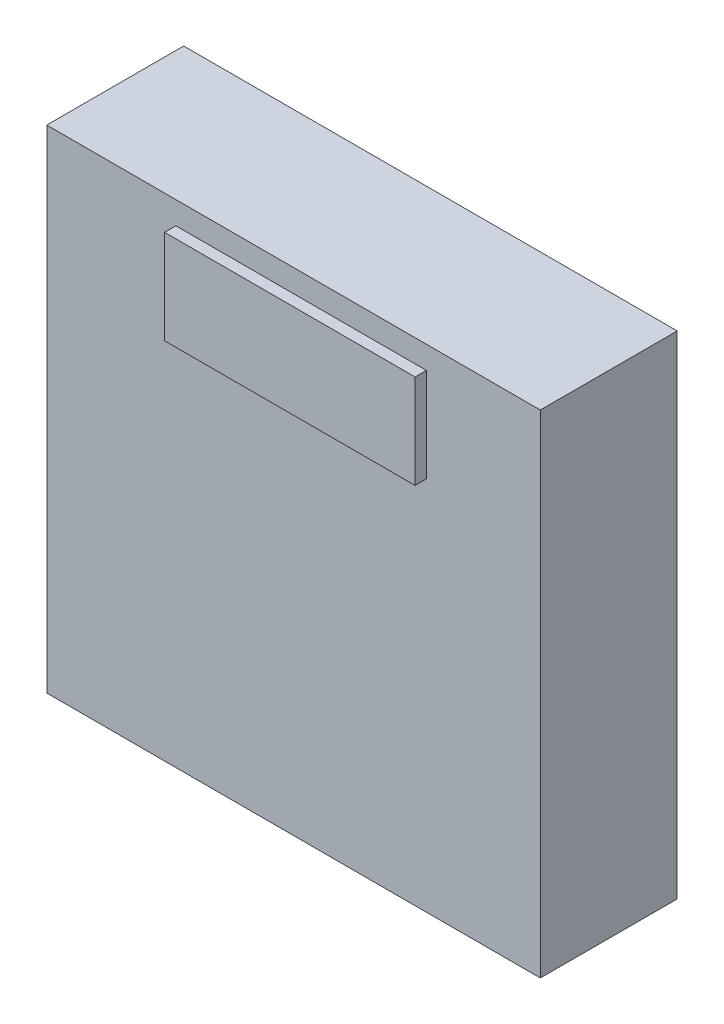
ISO-10303-21;
HEADER;
FILE_DESCRIPTION(('STEP AP214'),'2;1');
FILE_NAME('part.step','',(''),(''),'','','');
FILE_SCHEMA(('AUTOMOTIVE_DESIGN { 1 0 10303 214 1 1 1 1 }'));
ENDSEC;
DATA;
#1=APPLICATION_CONTEXT('core data for automotive mechanical design processes');
#2=APPLICATION_PROTOCOL_DEFINITION('international standard','automotive_design',2000,#1);
#3=PRODUCT_CONTEXT('',#1,'mechanical');
#4=PRODUCT('Part','Part','',(#3));
#5=PRODUCT_RELATED_PRODUCT_CATEGORY('part','',(#4));
#6=PRODUCT_DEFINITION_FORMATION('','',#4);
#7=PRODUCT_DEFINITION_CONTEXT('part definition',#1,'design');
#8=PRODUCT_DEFINITION('design','',#6,#7);
#9=PRODUCT_DEFINITION_SHAPE('','',#8);
#10=(LENGTH_UNIT() NAMED_UNIT(*) SI_UNIT(.MILLI.,.METRE.));
#11=(NAMED_UNIT(*) PLANE_ANGLE_UNIT() SI_UNIT($,.RADIAN.));
#12=(NAMED_UNIT(*) SI_UNIT($,.STERADIAN.) SOLID_ANGLE_UNIT());
#13=UNCERTAINTY_MEASURE_WITH_UNIT(LENGTH_MEASURE(1.E-05),#10,'distance_accuracy_value','');
#14=(GEOMETRIC_REPRESENTATION_CONTEXT(3) GLOBAL_UNCERTAINTY_ASSIGNED_CONTEXT((#13)) GLOBAL_UNIT_ASSIGNED_CONTEXT((#10,
#11,#12)) REPRESENTATION_CONTEXT('',''));
#15=CARTESIAN_POINT('',(0.,0.,0.));
#16=DIRECTION('',(0.,0.,1.));
#17=DIRECTION('',(1.,0.,0.));
#18=AXIS2_PLACEMENT_3D('',#15,#16,#17);
#19=CARTESIAN_POINT('',(0.,0.,30.6832));
#20=DIRECTION('',(0.,0.,1.));
#21=DIRECTION('',(1.,0.,0.));
#22=AXIS2_PLACEMENT_3D('',#19,#20,#21);
#23=PLANE('',#22);
#24=DIRECTION('',(0.,-1.,0.));
#25=VECTOR('',#24,1.);
#26=CARTESIAN_POINT('',(-55.2958,-55.11165,30.6832));
#27=LINE('',#26,#25);
#28=CARTESIAN_POINT('',(-55.2958,55.11165,30.6832));
#29=VERTEX_POINT('',#28);
#30=CARTESIAN_POINT('',(-55.2958,-55.11165,30.6832));
#31=VERTEX_POINT('',#30);
#32=EDGE_CURVE('E142',#29,#31,#27,.T.);
#33=ORIENTED_EDGE('',*,*,#32,.T.);
#34=DIRECTION('',(1.,0.,0.));
#35=VECTOR('',#34,1.);
#36=CARTESIAN_POINT('',(55.2958,-55.11165,30.6832));
#37=LINE('',#36,#35);
#38=CARTESIAN_POINT('',(55.2958,-55.11165,30.6832));
#39=VERTEX_POINT('',#38);
#40=EDGE_CURVE('E87',#31,#39,#37,.T.);
#41=ORIENTED_EDGE('',*,*,#40,.T.);
#42=DIRECTION('',(0.,1.,0.));
#43=VECTOR('',#42,1.);
#44=CARTESIAN_POINT('',(55.2958,-55.11165,30.6832));
#45=LINE('',#44,#43);
#46=CARTESIAN_POINT('',(55.2958,55.11165,30.6832));
#47=VERTEX_POINT('',#46);
#48=EDGE_CURVE('E145',#39,#47,#45,.T.);
#49=ORIENTED_EDGE('',*,*,#48,.T.);
#50=DIRECTION('',(-1.,0.,0.));
#51=VECTOR('',#50,1.);
#52=CARTESIAN_POINT('',(55.2958,55.11165,30.6832));
#53=LINE('',#52,#51);
#54=EDGE_CURVE('E59',#47,#29,#53,.T.);
#55=ORIENTED_EDGE('',*,*,#54,.T.);
#56=EDGE_LOOP('',(#33,#41,#49,#55));
#57=FACE_BOUND('',#56,.T.);
#58=DIRECTION('',(1.,0.,0.));
#59=VECTOR('',#58,1.);
#60=CARTESIAN_POINT('',(-26.3652,28.98775,30.6832));
#61=LINE('',#60,#59);
#62=CARTESIAN_POINT('',(-26.3652,28.98775,30.6832));
#63=VERTEX_POINT('',#62);
#64=CARTESIAN_POINT('',(29.7688,28.98775,30.6832));
#65=VERTEX_POINT('',#64);
#66=EDGE_CURVE('E267',#63,#65,#61,.T.);
#67=ORIENTED_EDGE('',*,*,#66,.F.);
#68=DIRECTION('',(0.,-1.,0.));
#69=VECTOR('',#68,1.);
#70=CARTESIAN_POINT('',(-26.3652,50.03165,30.6832));
#71=LINE('',#70,#69);
#72=CARTESIAN_POINT('',(-26.3652,50.03165,30.6832));
#73=VERTEX_POINT('',#72);
#74=EDGE_CURVE('E132',#73,#63,#71,.T.);
#75=ORIENTED_EDGE('',*,*,#74,.F.);
#76=DIRECTION('',(-1.,0.,0.));
#77=VECTOR('',#76,1.);
#78=CARTESIAN_POINT('',(-26.3652,50.03165,30.6832));
#79=LINE('',#78,#77);
#80=CARTESIAN_POINT('',(29.7688,50.03165,30.6832));
#81=VERTEX_POINT('',#80);
#82=EDGE_CURVE('E128',#81,#73,#79,.T.);
#83=ORIENTED_EDGE('',*,*,#82,.F.);
#84=DIRECTION('',(0.,1.,0.));
#85=VECTOR('',#84,1.);
#86=CARTESIAN_POINT('',(29.7688,50.03165,30.6832));
#87=LINE('',#86,#85);
#88=EDGE_CURVE('E264',#65,#81,#87,.T.);
#89=ORIENTED_EDGE('',*,*,#88,.F.);
#90=EDGE_LOOP('',(#67,#75,#83,#89));
#91=FACE_BOUND('',#90,.T.);
#92=ADVANCED_FACE('F35',(#57,#91),#23,.T.);
#93=CARTESIAN_POINT('',(-55.2958,-55.11165,30.6832));
#94=DIRECTION('',(1.,0.,0.));
#95=DIRECTION('',(0.,0.,-1.));
#96=AXIS2_PLACEMENT_3D('',#93,#94,#95);
#97=PLANE('',#96);
#98=DIRECTION('',(0.,-1.,0.));
#99=VECTOR('',#98,1.);
#100=CARTESIAN_POINT('',(-55.2958,-55.11165,0.));
#101=LINE('',#100,#99);
#102=CARTESIAN_POINT('',(-55.2958,55.11165,0.));
#103=VERTEX_POINT('',#102);
#104=CARTESIAN_POINT('',(-55.2958,-55.11165,0.));
#105=VERTEX_POINT('',#104);
#106=EDGE_CURVE('E134',#103,#105,#101,.T.);
#107=ORIENTED_EDGE('',*,*,#106,.T.);
#108=DIRECTION('',(0.,0.,-1.));
#109=VECTOR('',#108,1.);
#110=CARTESIAN_POINT('',(-55.2958,-55.11165,30.6832));
#111=LINE('',#110,#109);
#112=EDGE_CURVE('E11',#31,#105,#111,.T.);
#113=ORIENTED_EDGE('',*,*,#112,.F.);
#114=ORIENTED_EDGE('',*,*,#32,.F.);
#115=DIRECTION('',(0.,0.,-1.));
#116=VECTOR('',#115,1.);
#117=CARTESIAN_POINT('',(-55.2958,55.11165,30.6832));
#118=LINE('',#117,#116);
#119=EDGE_CURVE('E147',#29,#103,#118,.T.);
#120=ORIENTED_EDGE('',*,*,#119,.T.);
#121=EDGE_LOOP('',(#107,#113,#114,#120));
#122=FACE_BOUND('',#121,.T.);
#123=ADVANCED_FACE('F37',(#122),#97,.F.);
#124=CARTESIAN_POINT('',(55.2958,-55.11165,30.6832));
#125=DIRECTION('',(0.,1.,0.));
#126=DIRECTION('',(0.,0.,1.));
#127=AXIS2_PLACEMENT_3D('',#124,#125,#126);
#128=PLANE('',#127);
#129=DIRECTION('',(1.,0.,0.));
#130=VECTOR('',#129,1.);
#131=CARTESIAN_POINT('',(55.2958,-55.11165,0.));
#132=LINE('',#131,#130);
#133=CARTESIAN_POINT('',(55.2958,-55.11165,0.));
#134=VERTEX_POINT('',#133);
#135=EDGE_CURVE('E137',#105,#134,#132,.T.);
#136=ORIENTED_EDGE('',*,*,#135,.T.);
#137=DIRECTION('',(0.,0.,-1.));
#138=VECTOR('',#137,1.);
#139=CARTESIAN_POINT('',(55.2958,-55.11165,30.6832));
#140=LINE('',#139,#138);
#141=EDGE_CURVE('E43',#39,#134,#140,.T.);
#142=ORIENTED_EDGE('',*,*,#141,.F.);
#143=ORIENTED_EDGE('',*,*,#40,.F.);
#144=ORIENTED_EDGE('',*,*,#112,.T.);
#145=EDGE_LOOP('',(#136,#142,#143,#144));
#146=FACE_BOUND('',#145,.T.);
#147=ADVANCED_FACE('F175',(#146),#128,.F.);
#148=CARTESIAN_POINT('',(55.2958,-55.11165,30.6832));
#149=DIRECTION('',(-1.,0.,0.));
#150=DIRECTION('',(0.,0.,1.));
#151=AXIS2_PLACEMENT_3D('',#148,#149,#150);
#152=PLANE('',#151);
#153=DIRECTION('',(0.,1.,0.));
#154=VECTOR('',#153,1.);
#155=CARTESIAN_POINT('',(55.2958,-55.11165,0.));
#156=LINE('',#155,#154);
#157=CARTESIAN_POINT('',(55.2958,55.11165,0.));
#158=VERTEX_POINT('',#157);
#159=EDGE_CURVE('E150',#134,#158,#156,.T.);
#160=ORIENTED_EDGE('',*,*,#159,.T.);
#161=DIRECTION('',(0.,0.,-1.));
#162=VECTOR('',#161,1.);
#163=CARTESIAN_POINT('',(55.2958,55.11165,30.6832));
#164=LINE('',#163,#162);
#165=EDGE_CURVE('E154',#47,#158,#164,.T.);
#166=ORIENTED_EDGE('',*,*,#165,.F.);
#167=ORIENTED_EDGE('',*,*,#48,.F.);
#168=ORIENTED_EDGE('',*,*,#141,.T.);
#169=EDGE_LOOP('',(#160,#166,#167,#168));
#170=FACE_BOUND('',#169,.T.);
#171=ADVANCED_FACE('F159',(#170),#152,.F.);
#172=CARTESIAN_POINT('',(55.2958,55.11165,30.6832));
#173=DIRECTION('',(0.,-1.,0.));
#174=DIRECTION('',(0.,0.,-1.));
#175=AXIS2_PLACEMENT_3D('',#172,#173,#174);
#176=PLANE('',#175);
#177=DIRECTION('',(-1.,0.,0.));
#178=VECTOR('',#177,1.);
#179=CARTESIAN_POINT('',(55.2958,55.11165,0.));
#180=LINE('',#179,#178);
#181=EDGE_CURVE('E80',#158,#103,#180,.T.);
#182=ORIENTED_EDGE('',*,*,#181,.T.);
#183=ORIENTED_EDGE('',*,*,#119,.F.);
#184=ORIENTED_EDGE('',*,*,#54,.F.);
#185=ORIENTED_EDGE('',*,*,#165,.T.);
#186=EDGE_LOOP('',(#182,#183,#184,#185));
#187=FACE_BOUND('',#186,.T.);
#188=ADVANCED_FACE('F167',(#187),#176,.F.);
#189=CARTESIAN_POINT('',(0.,0.,0.));
#190=DIRECTION('',(0.,0.,1.));
#191=DIRECTION('',(1.,0.,0.));
#192=AXIS2_PLACEMENT_3D('',#189,#190,#191);
#193=PLANE('',#192);
#194=ORIENTED_EDGE('',*,*,#106,.F.);
#195=ORIENTED_EDGE('',*,*,#181,.F.);
#196=ORIENTED_EDGE('',*,*,#159,.F.);
#197=ORIENTED_EDGE('',*,*,#135,.F.);
#198=EDGE_LOOP('',(#194,#195,#196,#197));
#199=FACE_BOUND('',#198,.T.);
#200=ADVANCED_FACE('F163',(#199),#193,.F.);
#201=CARTESIAN_POINT('',(-26.3652,50.03165,33.2232));
#202=DIRECTION('',(1.,0.,0.));
#203=DIRECTION('',(0.,0.,-1.));
#204=AXIS2_PLACEMENT_3D('',#201,#202,#203);
#205=PLANE('',#204);
#206=ORIENTED_EDGE('',*,*,#74,.T.);
#207=DIRECTION('',(0.,0.,-1.));
#208=VECTOR('',#207,1.);
#209=CARTESIAN_POINT('',(-26.3652,28.98775,33.2232));
#210=LINE('',#209,#208);
#211=CARTESIAN_POINT('',(-26.3652,28.98775,33.2232));
#212=VERTEX_POINT('',#211);
#213=EDGE_CURVE('E113',#212,#63,#210,.T.);
#214=ORIENTED_EDGE('',*,*,#213,.F.);
#215=DIRECTION('',(0.,-1.,0.));
#216=VECTOR('',#215,1.);
#217=CARTESIAN_POINT('',(-26.3652,50.03165,33.2232));
#218=LINE('',#217,#216);
#219=CARTESIAN_POINT('',(-26.3652,50.03165,33.2232));
#220=VERTEX_POINT('',#219);
#221=EDGE_CURVE('E120',#220,#212,#218,.T.);
#222=ORIENTED_EDGE('',*,*,#221,.F.);
#223=DIRECTION('',(0.,0.,-1.));
#224=VECTOR('',#223,1.);
#225=CARTESIAN_POINT('',(-26.3652,50.03165,33.2232));
#226=LINE('',#225,#224);
#227=EDGE_CURVE('E262',#220,#73,#226,.T.);
#228=ORIENTED_EDGE('',*,*,#227,.T.);
#229=EDGE_LOOP('',(#206,#214,#222,#228));
#230=FACE_BOUND('',#229,.T.);
#231=ADVANCED_FACE('F130',(#230),#205,.F.);
#232=CARTESIAN_POINT('',(-26.3652,28.98775,33.2232));
#233=DIRECTION('',(0.,1.,0.));
#234=DIRECTION('',(0.,0.,1.));
#235=AXIS2_PLACEMENT_3D('',#232,#233,#234);
#236=PLANE('',#235);
#237=ORIENTED_EDGE('',*,*,#66,.T.);
#238=DIRECTION('',(0.,0.,-1.));
#239=VECTOR('',#238,1.);
#240=CARTESIAN_POINT('',(29.7688,28.98775,33.2232));
#241=LINE('',#240,#239);
#242=CARTESIAN_POINT('',(29.7688,28.98775,33.2232));
#243=VERTEX_POINT('',#242);
#244=EDGE_CURVE('E116',#243,#65,#241,.T.);
#245=ORIENTED_EDGE('',*,*,#244,.F.);
#246=DIRECTION('',(1.,0.,0.));
#247=VECTOR('',#246,1.);
#248=CARTESIAN_POINT('',(-26.3652,28.98775,33.2232));
#249=LINE('',#248,#247);
#250=EDGE_CURVE('E109',#212,#243,#249,.T.);
#251=ORIENTED_EDGE('',*,*,#250,.F.);
#252=ORIENTED_EDGE('',*,*,#213,.T.);
#253=EDGE_LOOP('',(#237,#245,#251,#252));
#254=FACE_BOUND('',#253,.T.);
#255=ADVANCED_FACE('F111',(#254),#236,.F.);
#256=CARTESIAN_POINT('',(29.7688,50.03165,33.2232));
#257=DIRECTION('',(-1.,0.,0.));
#258=DIRECTION('',(0.,-1.,0.));
#259=AXIS2_PLACEMENT_3D('',#256,#257,#258);
#260=PLANE('',#259);
#261=ORIENTED_EDGE('',*,*,#88,.T.);
#262=DIRECTION('',(0.,0.,-1.));
#263=VECTOR('',#262,1.);
#264=CARTESIAN_POINT('',(29.7688,50.03165,33.2232));
#265=LINE('',#264,#263);
#266=CARTESIAN_POINT('',(29.7688,50.03165,33.2232));
#267=VERTEX_POINT('',#266);
#268=EDGE_CURVE('E50',#267,#81,#265,.T.);
#269=ORIENTED_EDGE('',*,*,#268,.F.);
#270=DIRECTION('',(0.,1.,0.));
#271=VECTOR('',#270,1.);
#272=CARTESIAN_POINT('',(29.7688,50.03165,33.2232));
#273=LINE('',#272,#271);
#274=EDGE_CURVE('E119',#243,#267,#273,.T.);
#275=ORIENTED_EDGE('',*,*,#274,.F.);
#276=ORIENTED_EDGE('',*,*,#244,.T.);
#277=EDGE_LOOP('',(#261,#269,#275,#276));
#278=FACE_BOUND('',#277,.T.);
#279=ADVANCED_FACE('F188',(#278),#260,.F.);
#280=CARTESIAN_POINT('',(-26.3652,50.03165,33.2232));
#281=DIRECTION('',(0.,-1.,0.));
#282=DIRECTION('',(0.,0.,-1.));
#283=AXIS2_PLACEMENT_3D('',#280,#281,#282);
#284=PLANE('',#283);
#285=ORIENTED_EDGE('',*,*,#82,.T.);
#286=ORIENTED_EDGE('',*,*,#227,.F.);
#287=DIRECTION('',(-1.,0.,0.));
#288=VECTOR('',#287,1.);
#289=CARTESIAN_POINT('',(-26.3652,50.03165,33.2232));
#290=LINE('',#289,#288);
#291=EDGE_CURVE('E124',#267,#220,#290,.T.);
#292=ORIENTED_EDGE('',*,*,#291,.F.);
#293=ORIENTED_EDGE('',*,*,#268,.T.);
#294=EDGE_LOOP('',(#285,#286,#292,#293));
#295=FACE_BOUND('',#294,.T.);
#296=ADVANCED_FACE('F191',(#295),#284,.F.);
#297=CARTESIAN_POINT('',(0.,0.,33.2232));
#298=DIRECTION('',(0.,0.,1.));
#299=DIRECTION('',(1.,0.,0.));
#300=AXIS2_PLACEMENT_3D('',#297,#298,#299);
#301=PLANE('',#300);
#302=ORIENTED_EDGE('',*,*,#221,.T.);
#303=ORIENTED_EDGE('',*,*,#250,.T.);
#304=ORIENTED_EDGE('',*,*,#274,.T.);
#305=ORIENTED_EDGE('',*,*,#291,.T.);
#306=EDGE_LOOP('',(#302,#303,#304,#305));
#307=FACE_BOUND('',#306,.T.);
#308=ADVANCED_FACE('F123',(#307),#301,.T.);
#309=CLOSED_SHELL('',(#92,#123,#147,#171,#188,#200,#231,#255,#279,#296,#308));
#310=MANIFOLD_SOLID_BREP('B2',#309);
#311=ADVANCED_BREP_SHAPE_REPRESENTATION('',(#18,#310),#14);
#312=SHAPE_DEFINITION_REPRESENTATION(#9,#311);
ENDSEC;
END-ISO-10303-21;
